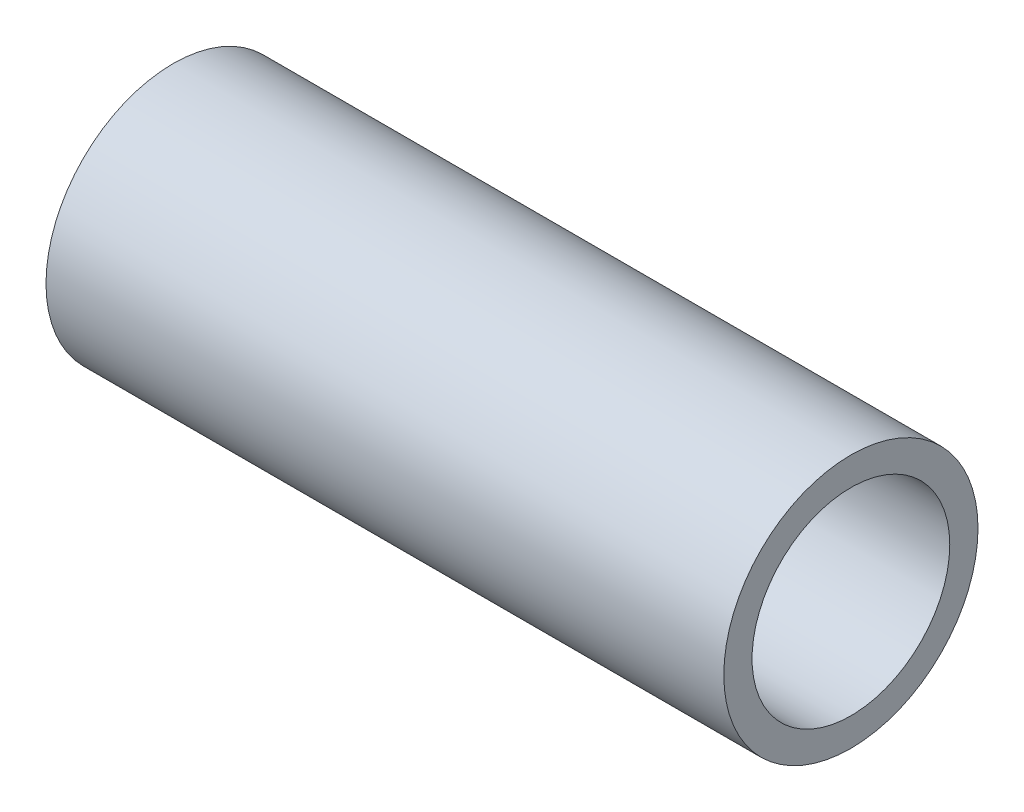
ISO-10303-21;
HEADER;
FILE_DESCRIPTION(('STEP AP214'),'2;1');
FILE_NAME('part.step','',(''),(''),'','','');
FILE_SCHEMA(('AUTOMOTIVE_DESIGN { 1 0 10303 214 1 1 1 1 }'));
ENDSEC;
DATA;
#1=APPLICATION_CONTEXT('core data for automotive mechanical design processes');
#2=APPLICATION_PROTOCOL_DEFINITION('international standard','automotive_design',2000,#1);
#3=PRODUCT_CONTEXT('',#1,'mechanical');
#4=PRODUCT('Part','Part','',(#3));
#5=PRODUCT_RELATED_PRODUCT_CATEGORY('part','',(#4));
#6=PRODUCT_DEFINITION_FORMATION('','',#4);
#7=PRODUCT_DEFINITION_CONTEXT('part definition',#1,'design');
#8=PRODUCT_DEFINITION('design','',#6,#7);
#9=PRODUCT_DEFINITION_SHAPE('','',#8);
#10=(LENGTH_UNIT() NAMED_UNIT(*) SI_UNIT(.MILLI.,.METRE.));
#11=(NAMED_UNIT(*) PLANE_ANGLE_UNIT() SI_UNIT($,.RADIAN.));
#12=(NAMED_UNIT(*) SI_UNIT($,.STERADIAN.) SOLID_ANGLE_UNIT());
#13=UNCERTAINTY_MEASURE_WITH_UNIT(LENGTH_MEASURE(1.E-05),#10,'distance_accuracy_value','');
#14=(GEOMETRIC_REPRESENTATION_CONTEXT(3) GLOBAL_UNCERTAINTY_ASSIGNED_CONTEXT((#13)) GLOBAL_UNIT_ASSIGNED_CONTEXT((#10,
#11,#12)) REPRESENTATION_CONTEXT('',''));
#15=CARTESIAN_POINT('',(0.,0.,0.));
#16=DIRECTION('',(0.,0.,1.));
#17=DIRECTION('',(1.,0.,0.));
#18=AXIS2_PLACEMENT_3D('',#15,#16,#17);
#19=CARTESIAN_POINT('',(24.,0.,0.));
#20=DIRECTION('',(1.,0.,0.));
#21=DIRECTION('',(0.,0.,-1.));
#22=AXIS2_PLACEMENT_3D('',#19,#20,#21);
#23=PLANE('',#22);
#24=CARTESIAN_POINT('',(24.,0.,0.));
#25=DIRECTION('',(1.,0.,0.));
#26=DIRECTION('',(0.,0.,-1.));
#27=AXIS2_PLACEMENT_3D('',#24,#25,#26);
#28=CIRCLE('',#27,9.);
#29=CARTESIAN_POINT('',(24.,0.,-9.));
#30=VERTEX_POINT('',#29);
#31=EDGE_CURVE('E10',#30,#30,#28,.T.);
#32=ORIENTED_EDGE('',*,*,#31,.T.);
#33=EDGE_LOOP('',(#32));
#34=FACE_BOUND('',#33,.T.);
#35=CARTESIAN_POINT('',(24.,0.,0.));
#36=DIRECTION('',(1.,0.,0.));
#37=DIRECTION('',(0.,0.,-1.));
#38=AXIS2_PLACEMENT_3D('',#35,#36,#37);
#39=CIRCLE('',#38,7.);
#40=CARTESIAN_POINT('',(24.,0.,-7.));
#41=VERTEX_POINT('',#40);
#42=EDGE_CURVE('E42',#41,#41,#39,.T.);
#43=ORIENTED_EDGE('',*,*,#42,.F.);
#44=EDGE_LOOP('',(#43));
#45=FACE_BOUND('',#44,.T.);
#46=ADVANCED_FACE('F31',(#34,#45),#23,.T.);
#47=CARTESIAN_POINT('',(-24.,0.,0.));
#48=DIRECTION('',(1.,0.,0.));
#49=DIRECTION('',(0.,0.,-1.));
#50=AXIS2_PLACEMENT_3D('',#47,#48,#49);
#51=PLANE('',#50);
#52=CARTESIAN_POINT('',(-24.,0.,0.));
#53=DIRECTION('',(1.,0.,0.));
#54=DIRECTION('',(0.,0.,-1.));
#55=AXIS2_PLACEMENT_3D('',#52,#53,#54);
#56=CIRCLE('',#55,9.);
#57=CARTESIAN_POINT('',(-24.,0.,-9.));
#58=VERTEX_POINT('',#57);
#59=EDGE_CURVE('E35',#58,#58,#56,.T.);
#60=ORIENTED_EDGE('',*,*,#59,.F.);
#61=EDGE_LOOP('',(#60));
#62=FACE_BOUND('',#61,.T.);
#63=CARTESIAN_POINT('',(-24.,0.,0.));
#64=DIRECTION('',(1.,0.,0.));
#65=DIRECTION('',(0.,0.,-1.));
#66=AXIS2_PLACEMENT_3D('',#63,#64,#65);
#67=CIRCLE('',#66,7.);
#68=CARTESIAN_POINT('',(-24.,0.,-7.));
#69=VERTEX_POINT('',#68);
#70=EDGE_CURVE('E44',#69,#69,#67,.T.);
#71=ORIENTED_EDGE('',*,*,#70,.T.);
#72=EDGE_LOOP('',(#71));
#73=FACE_BOUND('',#72,.T.);
#74=ADVANCED_FACE('F54',(#62,#73),#51,.F.);
#75=CARTESIAN_POINT('',(24.,0.,0.));
#76=DIRECTION('',(-1.,0.,0.));
#77=DIRECTION('',(0.,0.,1.));
#78=AXIS2_PLACEMENT_3D('',#75,#76,#77);
#79=CYLINDRICAL_SURFACE('',#78,9.);
#80=ORIENTED_EDGE('',*,*,#31,.F.);
#81=EDGE_LOOP('',(#80));
#82=FACE_BOUND('',#81,.T.);
#83=ORIENTED_EDGE('',*,*,#59,.T.);
#84=EDGE_LOOP('',(#83));
#85=FACE_BOUND('',#84,.T.);
#86=ADVANCED_FACE('F33',(#82,#85),#79,.T.);
#87=CARTESIAN_POINT('',(24.,0.,0.));
#88=DIRECTION('',(-1.,0.,0.));
#89=DIRECTION('',(0.,0.,1.));
#90=AXIS2_PLACEMENT_3D('',#87,#88,#89);
#91=CYLINDRICAL_SURFACE('',#90,7.);
#92=ORIENTED_EDGE('',*,*,#42,.T.);
#93=EDGE_LOOP('',(#92));
#94=FACE_BOUND('',#93,.T.);
#95=ORIENTED_EDGE('',*,*,#70,.F.);
#96=EDGE_LOOP('',(#95));
#97=FACE_BOUND('',#96,.T.);
#98=ADVANCED_FACE('F50',(#94,#97),#91,.F.);
#99=CLOSED_SHELL('',(#46,#74,#86,#98));
#100=MANIFOLD_SOLID_BREP('B2',#99);
#101=ADVANCED_BREP_SHAPE_REPRESENTATION('',(#18,#100),#14);
#102=SHAPE_DEFINITION_REPRESENTATION(#9,#101);
ENDSEC;
END-ISO-10303-21;
